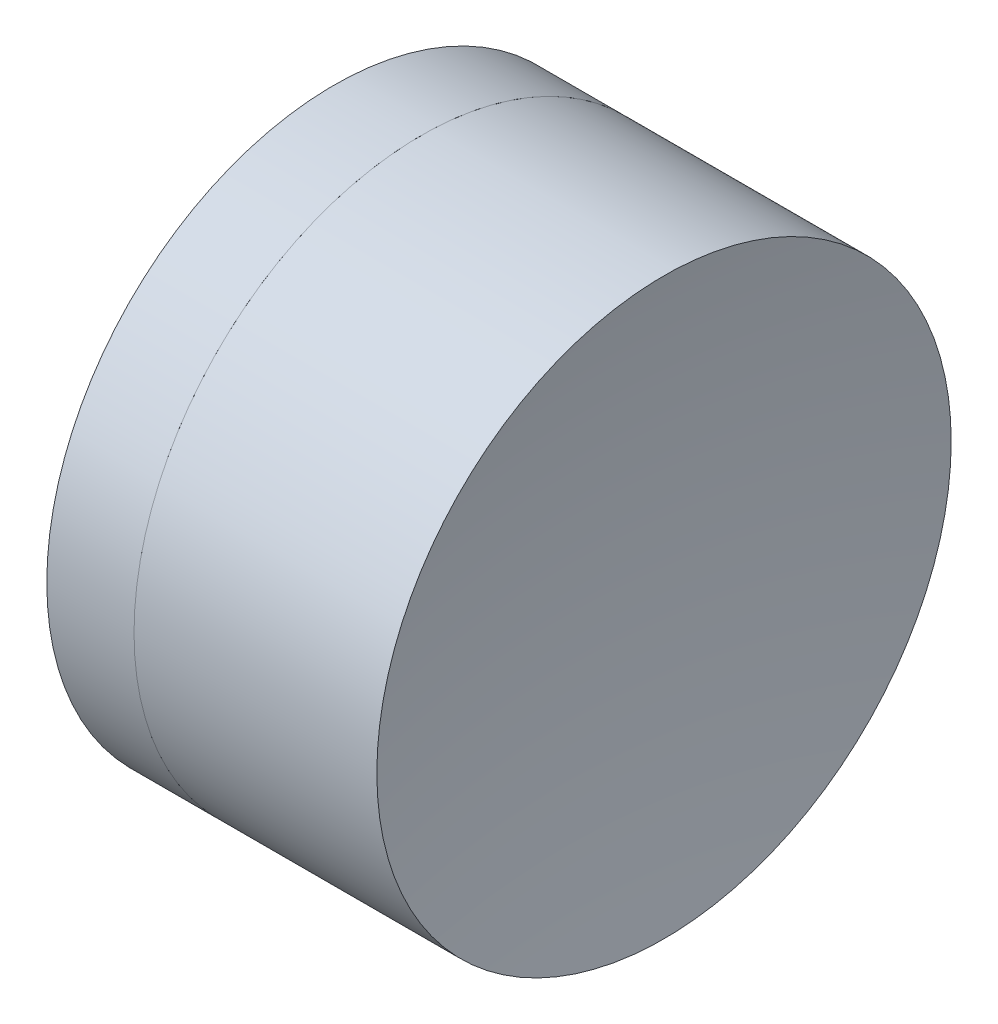
ISO-10303-21;
HEADER;
FILE_DESCRIPTION(('STEP AP214'),'2;1');
FILE_NAME('part.step','',(''),(''),'','','');
FILE_SCHEMA(('AUTOMOTIVE_DESIGN { 1 0 10303 214 1 1 1 1 }'));
ENDSEC;
DATA;
#1=APPLICATION_CONTEXT('core data for automotive mechanical design processes');
#2=APPLICATION_PROTOCOL_DEFINITION('international standard','automotive_design',2000,#1);
#3=PRODUCT_CONTEXT('',#1,'mechanical');
#4=PRODUCT('Part','Part','',(#3));
#5=PRODUCT_RELATED_PRODUCT_CATEGORY('part','',(#4));
#6=PRODUCT_DEFINITION_FORMATION('','',#4);
#7=PRODUCT_DEFINITION_CONTEXT('part definition',#1,'design');
#8=PRODUCT_DEFINITION('design','',#6,#7);
#9=PRODUCT_DEFINITION_SHAPE('','',#8);
#10=(LENGTH_UNIT() NAMED_UNIT(*) SI_UNIT(.MILLI.,.METRE.));
#11=(NAMED_UNIT(*) PLANE_ANGLE_UNIT() SI_UNIT($,.RADIAN.));
#12=(NAMED_UNIT(*) SI_UNIT($,.STERADIAN.) SOLID_ANGLE_UNIT());
#13=UNCERTAINTY_MEASURE_WITH_UNIT(LENGTH_MEASURE(1.E-05),#10,'distance_accuracy_value','');
#14=(GEOMETRIC_REPRESENTATION_CONTEXT(3) GLOBAL_UNCERTAINTY_ASSIGNED_CONTEXT((#13)) GLOBAL_UNIT_ASSIGNED_CONTEXT((#10,
#11,#12)) REPRESENTATION_CONTEXT('',''));
#15=CARTESIAN_POINT('',(0.,0.,0.));
#16=DIRECTION('',(0.,0.,1.));
#17=DIRECTION('',(1.,0.,0.));
#18=AXIS2_PLACEMENT_3D('',#15,#16,#17);
#19=CARTESIAN_POINT('',(-1.51397751524145,0.,0.));
#20=DIRECTION('',(-1.,0.,0.));
#21=DIRECTION('',(0.,0.,-1.));
#22=AXIS2_PLACEMENT_3D('',#19,#20,#21);
#23=SPHERICAL_SURFACE('',#22,5.45);
#24=CARTESIAN_POINT('',(3.32880061306465,0.,0.));
#25=DIRECTION('',(-1.,0.,0.));
#26=DIRECTION('',(0.,0.,1.));
#27=AXIS2_PLACEMENT_3D('',#24,#25,#26);
#28=CIRCLE('',#27,2.5);
#29=CARTESIAN_POINT('',(3.32880061306465,0.,2.5));
#30=VERTEX_POINT('',#29);
#31=EDGE_CURVE('E51',#30,#30,#28,.T.);
#32=ORIENTED_EDGE('',*,*,#31,.T.);
#33=EDGE_LOOP('',(#32));
#34=FACE_BOUND('',#33,.T.);
#35=ADVANCED_FACE('F45',(#34),#23,.F.);
#36=CARTESIAN_POINT('',(20.4760224847585,0.,0.));
#37=DIRECTION('',(-1.,0.,0.));
#38=DIRECTION('',(0.,0.,-1.));
#39=AXIS2_PLACEMENT_3D('',#36,#37,#38);
#40=SPHERICAL_SURFACE('',#39,15.24);
#41=CARTESIAN_POINT('',(5.44247333627069,0.,0.));
#42=DIRECTION('',(-1.,0.,0.));
#43=DIRECTION('',(0.,0.,1.));
#44=AXIS2_PLACEMENT_3D('',#41,#42,#43);
#45=CIRCLE('',#44,2.5);
#46=CARTESIAN_POINT('',(5.44247333627069,0.,2.5));
#47=VERTEX_POINT('',#46);
#48=EDGE_CURVE('E11',#47,#47,#45,.T.);
#49=ORIENTED_EDGE('',*,*,#48,.F.);
#50=EDGE_LOOP('',(#49));
#51=FACE_BOUND('',#50,.T.);
#52=ADVANCED_FACE('F60',(#51),#40,.F.);
#53=CARTESIAN_POINT('',(-0.551919992657797,0.,0.));
#54=DIRECTION('',(-1.,0.,0.));
#55=DIRECTION('',(0.,0.,1.));
#56=AXIS2_PLACEMENT_3D('',#53,#54,#55);
#57=CYLINDRICAL_SURFACE('',#56,2.5);
#58=ORIENTED_EDGE('',*,*,#48,.T.);
#59=EDGE_LOOP('',(#58));
#60=FACE_BOUND('',#59,.T.);
#61=ORIENTED_EDGE('',*,*,#31,.F.);
#62=EDGE_LOOP('',(#61));
#63=FACE_BOUND('',#62,.T.);
#64=ADVANCED_FACE('F58',(#60,#63),#57,.T.);
#65=CLOSED_SHELL('',(#35,#52,#64));
#66=MANIFOLD_SOLID_BREP('B2',#65);
#67=CARTESIAN_POINT('',(7.18602248475855,0.,0.));
#68=DIRECTION('',(-1.,0.,0.));
#69=DIRECTION('',(0.,0.,1.));
#70=AXIS2_PLACEMENT_3D('',#67,#68,#69);
#71=SPHERICAL_SURFACE('',#70,5.25);
#72=CARTESIAN_POINT('',(2.5694761566037,0.,0.));
#73=DIRECTION('',(-1.,0.,0.));
#74=DIRECTION('',(0.,0.,1.));
#75=AXIS2_PLACEMENT_3D('',#72,#73,#74);
#76=CIRCLE('',#75,2.5);
#77=CARTESIAN_POINT('',(2.5694761566037,0.,2.5));
#78=VERTEX_POINT('',#77);
#79=EDGE_CURVE('E44',#78,#78,#76,.T.);
#80=ORIENTED_EDGE('',*,*,#79,.T.);
#81=EDGE_LOOP('',(#80));
#82=FACE_BOUND('',#81,.T.);
#83=ADVANCED_FACE('F86',(#82),#71,.T.);
#84=CARTESIAN_POINT('',(-0.816062176165804,0.,0.));
#85=DIRECTION('',(-1.,0.,0.));
#86=DIRECTION('',(0.,0.,1.));
#87=AXIS2_PLACEMENT_3D('',#84,#85,#86);
#88=CYLINDRICAL_SURFACE('',#87,2.5);
#89=CARTESIAN_POINT('',(3.32880061306465,0.,0.));
#90=DIRECTION('',(-1.,0.,0.));
#91=DIRECTION('',(0.,0.,1.));
#92=AXIS2_PLACEMENT_3D('',#89,#90,#91);
#93=CIRCLE('',#92,2.5);
#94=CARTESIAN_POINT('',(3.32880061306465,0.,2.5));
#95=VERTEX_POINT('',#94);
#96=EDGE_CURVE('E92',#95,#95,#93,.T.);
#97=ORIENTED_EDGE('',*,*,#96,.T.);
#98=EDGE_LOOP('',(#97));
#99=FACE_BOUND('',#98,.T.);
#100=ORIENTED_EDGE('',*,*,#79,.F.);
#101=EDGE_LOOP('',(#100));
#102=FACE_BOUND('',#101,.T.);
#103=ADVANCED_FACE('F98',(#99,#102),#88,.T.);
#104=CARTESIAN_POINT('',(-1.51397751524145,0.,0.));
#105=DIRECTION('',(-1.,0.,0.));
#106=DIRECTION('',(0.,0.,1.));
#107=AXIS2_PLACEMENT_3D('',#104,#105,#106);
#108=SPHERICAL_SURFACE('',#107,5.45);
#109=ORIENTED_EDGE('',*,*,#96,.F.);
#110=EDGE_LOOP('',(#109));
#111=FACE_BOUND('',#110,.T.);
#112=ADVANCED_FACE('F101',(#111),#108,.T.);
#113=CLOSED_SHELL('',(#83,#103,#112));
#114=MANIFOLD_SOLID_BREP('B6',#113);
#115=ADVANCED_BREP_SHAPE_REPRESENTATION('',(#18,#66,#114),#14);
#116=SHAPE_DEFINITION_REPRESENTATION(#9,#115);
ENDSEC;
END-ISO-10303-21;
